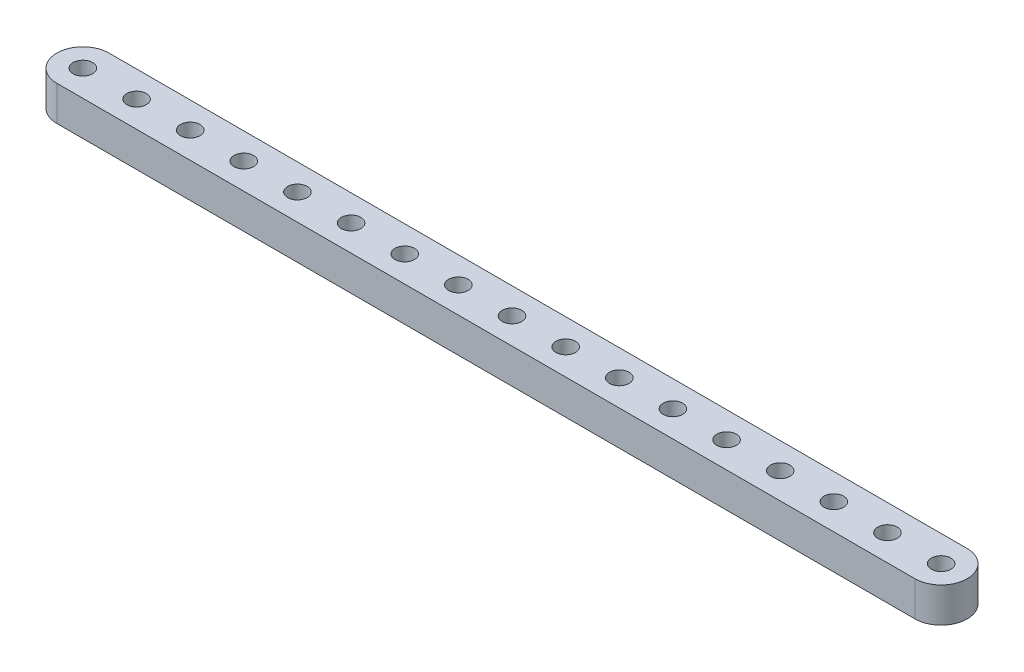
ISO-10303-21;
HEADER;
FILE_DESCRIPTION(('STEP AP214'),'2;1');
FILE_NAME('part.step','',(''),(''),'','','');
FILE_SCHEMA(('AUTOMOTIVE_DESIGN { 1 0 10303 214 1 1 1 1 }'));
ENDSEC;
DATA;
#1=APPLICATION_CONTEXT('core data for automotive mechanical design processes');
#2=APPLICATION_PROTOCOL_DEFINITION('international standard','automotive_design',2000,#1);
#3=PRODUCT_CONTEXT('',#1,'mechanical');
#4=PRODUCT('Part','Part','',(#3));
#5=PRODUCT_RELATED_PRODUCT_CATEGORY('part','',(#4));
#6=PRODUCT_DEFINITION_FORMATION('','',#4);
#7=PRODUCT_DEFINITION_CONTEXT('part definition',#1,'design');
#8=PRODUCT_DEFINITION('design','',#6,#7);
#9=PRODUCT_DEFINITION_SHAPE('','',#8);
#10=(LENGTH_UNIT() NAMED_UNIT(*) SI_UNIT(.MILLI.,.METRE.));
#11=(NAMED_UNIT(*) PLANE_ANGLE_UNIT() SI_UNIT($,.RADIAN.));
#12=(NAMED_UNIT(*) SI_UNIT($,.STERADIAN.) SOLID_ANGLE_UNIT());
#13=UNCERTAINTY_MEASURE_WITH_UNIT(LENGTH_MEASURE(1.E-05),#10,'distance_accuracy_value','');
#14=(GEOMETRIC_REPRESENTATION_CONTEXT(3) GLOBAL_UNCERTAINTY_ASSIGNED_CONTEXT((#13)) GLOBAL_UNIT_ASSIGNED_CONTEXT((#10,
#11,#12)) REPRESENTATION_CONTEXT('',''));
#15=CARTESIAN_POINT('',(0.,0.,0.));
#16=DIRECTION('',(0.,0.,1.));
#17=DIRECTION('',(1.,0.,0.));
#18=AXIS2_PLACEMENT_3D('',#15,#16,#17);
#19=CARTESIAN_POINT('',(78.232,0.,0.));
#20=DIRECTION('',(0.,1.,0.));
#21=DIRECTION('',(0.,0.,1.));
#22=AXIS2_PLACEMENT_3D('',#19,#20,#21);
#23=CYLINDRICAL_SURFACE('',#22,4.76250000000002);
#24=CARTESIAN_POINT('',(78.232,6.35,0.));
#25=DIRECTION('',(0.,1.,0.));
#26=DIRECTION('',(0.,0.,1.));
#27=AXIS2_PLACEMENT_3D('',#24,#25,#26);
#28=CIRCLE('',#27,4.76250000000002);
#29=CARTESIAN_POINT('',(78.232,6.35,4.76250000000002));
#30=VERTEX_POINT('',#29);
#31=CARTESIAN_POINT('',(78.232,6.35,-4.76250000000002));
#32=VERTEX_POINT('',#31);
#33=EDGE_CURVE('E99',#30,#32,#28,.T.);
#34=ORIENTED_EDGE('',*,*,#33,.F.);
#35=DIRECTION('',(0.,1.,0.));
#36=VECTOR('',#35,1.);
#37=CARTESIAN_POINT('',(78.232,0.,4.76250000000002));
#38=LINE('',#37,#36);
#39=CARTESIAN_POINT('',(78.232,0.,4.76250000000002));
#40=VERTEX_POINT('',#39);
#41=EDGE_CURVE('E11',#40,#30,#38,.T.);
#42=ORIENTED_EDGE('',*,*,#41,.F.);
#43=CARTESIAN_POINT('',(78.232,0.,0.));
#44=DIRECTION('',(0.,1.,0.));
#45=DIRECTION('',(0.,0.,1.));
#46=AXIS2_PLACEMENT_3D('',#43,#44,#45);
#47=CIRCLE('',#46,4.76250000000002);
#48=CARTESIAN_POINT('',(78.232,0.,-4.76250000000002));
#49=VERTEX_POINT('',#48);
#50=EDGE_CURVE('E92',#40,#49,#47,.T.);
#51=ORIENTED_EDGE('',*,*,#50,.T.);
#52=DIRECTION('',(0.,1.,0.));
#53=VECTOR('',#52,1.);
#54=CARTESIAN_POINT('',(78.232,0.,-4.76250000000002));
#55=LINE('',#54,#53);
#56=EDGE_CURVE('E37',#49,#32,#55,.T.);
#57=ORIENTED_EDGE('',*,*,#56,.T.);
#58=EDGE_LOOP('',(#34,#42,#51,#57));
#59=FACE_BOUND('',#58,.T.);
#60=ADVANCED_FACE('F34',(#59),#23,.T.);
#61=CARTESIAN_POINT('',(-78.232,0.,4.76250000000002));
#62=DIRECTION('',(0.,0.,1.));
#63=DIRECTION('',(1.,0.,0.));
#64=AXIS2_PLACEMENT_3D('',#61,#62,#63);
#65=PLANE('',#64);
#66=DIRECTION('',(1.,0.,0.));
#67=VECTOR('',#66,1.);
#68=CARTESIAN_POINT('',(-78.232,6.35,4.76250000000002));
#69=LINE('',#68,#67);
#70=CARTESIAN_POINT('',(-78.232,6.35,4.76250000000002));
#71=VERTEX_POINT('',#70);
#72=EDGE_CURVE('E94',#71,#30,#69,.T.);
#73=ORIENTED_EDGE('',*,*,#72,.F.);
#74=DIRECTION('',(0.,1.,0.));
#75=VECTOR('',#74,1.);
#76=CARTESIAN_POINT('',(-78.232,0.,4.76250000000002));
#77=LINE('',#76,#75);
#78=CARTESIAN_POINT('',(-78.232,0.,4.76250000000002));
#79=VERTEX_POINT('',#78);
#80=EDGE_CURVE('E43',#79,#71,#77,.T.);
#81=ORIENTED_EDGE('',*,*,#80,.F.);
#82=DIRECTION('',(1.,0.,0.));
#83=VECTOR('',#82,1.);
#84=CARTESIAN_POINT('',(-78.232,0.,4.76250000000002));
#85=LINE('',#84,#83);
#86=EDGE_CURVE('E89',#79,#40,#85,.T.);
#87=ORIENTED_EDGE('',*,*,#86,.T.);
#88=ORIENTED_EDGE('',*,*,#41,.T.);
#89=EDGE_LOOP('',(#73,#81,#87,#88));
#90=FACE_BOUND('',#89,.T.);
#91=ADVANCED_FACE('F110',(#90),#65,.T.);
#92=CARTESIAN_POINT('',(-78.232,0.,0.));
#93=DIRECTION('',(0.,1.,0.));
#94=DIRECTION('',(0.,0.,1.));
#95=AXIS2_PLACEMENT_3D('',#92,#93,#94);
#96=CYLINDRICAL_SURFACE('',#95,4.76250000000001);
#97=CARTESIAN_POINT('',(-78.232,6.35,0.));
#98=DIRECTION('',(0.,1.,0.));
#99=DIRECTION('',(0.,0.,1.));
#100=AXIS2_PLACEMENT_3D('',#97,#98,#99);
#101=CIRCLE('',#100,4.76250000000001);
#102=CARTESIAN_POINT('',(-78.232,6.35,-4.7625));
#103=VERTEX_POINT('',#102);
#104=EDGE_CURVE('E84',#103,#71,#101,.T.);
#105=ORIENTED_EDGE('',*,*,#104,.F.);
#106=DIRECTION('',(0.,1.,0.));
#107=VECTOR('',#106,1.);
#108=CARTESIAN_POINT('',(-78.232,0.,-4.7625));
#109=LINE('',#108,#107);
#110=CARTESIAN_POINT('',(-78.232,0.,-4.7625));
#111=VERTEX_POINT('',#110);
#112=EDGE_CURVE('E79',#111,#103,#109,.T.);
#113=ORIENTED_EDGE('',*,*,#112,.F.);
#114=CARTESIAN_POINT('',(-78.232,0.,0.));
#115=DIRECTION('',(0.,1.,0.));
#116=DIRECTION('',(0.,0.,1.));
#117=AXIS2_PLACEMENT_3D('',#114,#115,#116);
#118=CIRCLE('',#117,4.76250000000001);
#119=EDGE_CURVE('E82',#111,#79,#118,.T.);
#120=ORIENTED_EDGE('',*,*,#119,.T.);
#121=ORIENTED_EDGE('',*,*,#80,.T.);
#122=EDGE_LOOP('',(#105,#113,#120,#121));
#123=FACE_BOUND('',#122,.T.);
#124=ADVANCED_FACE('F81',(#123),#96,.T.);
#125=CARTESIAN_POINT('',(78.232,0.,-4.76250000000002));
#126=DIRECTION('',(0.,0.,-1.));
#127=DIRECTION('',(-1.,0.,0.));
#128=AXIS2_PLACEMENT_3D('',#125,#126,#127);
#129=PLANE('',#128);
#130=DIRECTION('',(-1.,0.,0.));
#131=VECTOR('',#130,1.);
#132=CARTESIAN_POINT('',(78.232,6.35,-4.76250000000002));
#133=LINE('',#132,#131);
#134=EDGE_CURVE('E102',#32,#103,#133,.T.);
#135=ORIENTED_EDGE('',*,*,#134,.F.);
#136=ORIENTED_EDGE('',*,*,#56,.F.);
#137=DIRECTION('',(-1.,0.,0.));
#138=VECTOR('',#137,1.);
#139=CARTESIAN_POINT('',(78.232,0.,-4.76250000000002));
#140=LINE('',#139,#138);
#141=EDGE_CURVE('E88',#49,#111,#140,.T.);
#142=ORIENTED_EDGE('',*,*,#141,.T.);
#143=ORIENTED_EDGE('',*,*,#112,.T.);
#144=EDGE_LOOP('',(#135,#136,#142,#143));
#145=FACE_BOUND('',#144,.T.);
#146=ADVANCED_FACE('F91',(#145),#129,.T.);
#147=CARTESIAN_POINT('',(78.232,0.,0.));
#148=DIRECTION('',(0.,1.,0.));
#149=DIRECTION('',(0.,0.,1.));
#150=AXIS2_PLACEMENT_3D('',#147,#148,#149);
#151=PLANE('',#150);
#152=CARTESIAN_POINT('',(-78.232,0.,0.));
#153=DIRECTION('',(0.,1.,0.));
#154=DIRECTION('',(0.,0.,-1.));
#155=AXIS2_PLACEMENT_3D('',#152,#153,#154);
#156=CIRCLE('',#155,1.77799999999997);
#157=CARTESIAN_POINT('',(-78.232,0.,-1.77799999999996));
#158=VERTEX_POINT('',#157);
#159=EDGE_CURVE('E203',#158,#158,#156,.T.);
#160=ORIENTED_EDGE('',*,*,#159,.T.);
#161=EDGE_LOOP('',(#160));
#162=FACE_BOUND('',#161,.T.);
#163=CARTESIAN_POINT('',(-68.453,0.,0.));
#164=DIRECTION('',(0.,1.,0.));
#165=DIRECTION('',(0.,0.,-1.));
#166=AXIS2_PLACEMENT_3D('',#163,#164,#165);
#167=CIRCLE('',#166,1.77799999999999);
#168=CARTESIAN_POINT('',(-68.453,0.,-1.77799999999999));
#169=VERTEX_POINT('',#168);
#170=EDGE_CURVE('E211',#169,#169,#167,.T.);
#171=ORIENTED_EDGE('',*,*,#170,.T.);
#172=EDGE_LOOP('',(#171));
#173=FACE_BOUND('',#172,.T.);
#174=CARTESIAN_POINT('',(-58.674,0.,0.));
#175=DIRECTION('',(0.,1.,0.));
#176=DIRECTION('',(0.,0.,-1.));
#177=AXIS2_PLACEMENT_3D('',#174,#175,#176);
#178=CIRCLE('',#177,1.77799999999999);
#179=CARTESIAN_POINT('',(-58.674,0.,-1.77799999999999));
#180=VERTEX_POINT('',#179);
#181=EDGE_CURVE('E217',#180,#180,#178,.T.);
#182=ORIENTED_EDGE('',*,*,#181,.T.);
#183=EDGE_LOOP('',(#182));
#184=FACE_BOUND('',#183,.T.);
#185=CARTESIAN_POINT('',(-48.895,0.,0.));
#186=DIRECTION('',(0.,1.,0.));
#187=DIRECTION('',(0.,0.,-1.));
#188=AXIS2_PLACEMENT_3D('',#185,#186,#187);
#189=CIRCLE('',#188,1.77799999999999);
#190=CARTESIAN_POINT('',(-48.895,0.,-1.77799999999999));
#191=VERTEX_POINT('',#190);
#192=EDGE_CURVE('E223',#191,#191,#189,.T.);
#193=ORIENTED_EDGE('',*,*,#192,.T.);
#194=EDGE_LOOP('',(#193));
#195=FACE_BOUND('',#194,.T.);
#196=CARTESIAN_POINT('',(-39.116,0.,0.));
#197=DIRECTION('',(0.,1.,0.));
#198=DIRECTION('',(0.,0.,-1.));
#199=AXIS2_PLACEMENT_3D('',#196,#197,#198);
#200=CIRCLE('',#199,1.77799999999999);
#201=CARTESIAN_POINT('',(-39.116,0.,-1.77799999999999));
#202=VERTEX_POINT('',#201);
#203=EDGE_CURVE('E229',#202,#202,#200,.T.);
#204=ORIENTED_EDGE('',*,*,#203,.T.);
#205=EDGE_LOOP('',(#204));
#206=FACE_BOUND('',#205,.T.);
#207=CARTESIAN_POINT('',(-29.337,0.,0.));
#208=DIRECTION('',(0.,1.,0.));
#209=DIRECTION('',(0.,0.,-1.));
#210=AXIS2_PLACEMENT_3D('',#207,#208,#209);
#211=CIRCLE('',#210,1.77799999999999);
#212=CARTESIAN_POINT('',(-29.337,0.,-1.77799999999998));
#213=VERTEX_POINT('',#212);
#214=EDGE_CURVE('E235',#213,#213,#211,.T.);
#215=ORIENTED_EDGE('',*,*,#214,.T.);
#216=EDGE_LOOP('',(#215));
#217=FACE_BOUND('',#216,.T.);
#218=CARTESIAN_POINT('',(-19.558,0.,0.));
#219=DIRECTION('',(0.,1.,0.));
#220=DIRECTION('',(0.,0.,-1.));
#221=AXIS2_PLACEMENT_3D('',#218,#219,#220);
#222=CIRCLE('',#221,1.77799999999999);
#223=CARTESIAN_POINT('',(-19.558,0.,-1.77799999999998));
#224=VERTEX_POINT('',#223);
#225=EDGE_CURVE('E241',#224,#224,#222,.T.);
#226=ORIENTED_EDGE('',*,*,#225,.T.);
#227=EDGE_LOOP('',(#226));
#228=FACE_BOUND('',#227,.T.);
#229=CARTESIAN_POINT('',(-9.77900000000001,0.,0.));
#230=DIRECTION('',(0.,1.,0.));
#231=DIRECTION('',(0.,0.,-1.));
#232=AXIS2_PLACEMENT_3D('',#229,#230,#231);
#233=CIRCLE('',#232,1.77799999999999);
#234=CARTESIAN_POINT('',(-9.77900000000001,0.,-1.77799999999998));
#235=VERTEX_POINT('',#234);
#236=EDGE_CURVE('E247',#235,#235,#233,.T.);
#237=ORIENTED_EDGE('',*,*,#236,.T.);
#238=EDGE_LOOP('',(#237));
#239=FACE_BOUND('',#238,.T.);
#240=CARTESIAN_POINT('',(0.,0.,0.));
#241=DIRECTION('',(0.,1.,0.));
#242=DIRECTION('',(0.,0.,-1.));
#243=AXIS2_PLACEMENT_3D('',#240,#241,#242);
#244=CIRCLE('',#243,1.77799999999999);
#245=CARTESIAN_POINT('',(0.,0.,-1.77799999999998));
#246=VERTEX_POINT('',#245);
#247=EDGE_CURVE('E253',#246,#246,#244,.T.);
#248=ORIENTED_EDGE('',*,*,#247,.T.);
#249=EDGE_LOOP('',(#248));
#250=FACE_BOUND('',#249,.T.);
#251=CARTESIAN_POINT('',(9.77899999999998,0.,0.));
#252=DIRECTION('',(0.,1.,0.));
#253=DIRECTION('',(0.,0.,-1.));
#254=AXIS2_PLACEMENT_3D('',#251,#252,#253);
#255=CIRCLE('',#254,1.77799999999999);
#256=CARTESIAN_POINT('',(9.77899999999998,0.,-1.77799999999998));
#257=VERTEX_POINT('',#256);
#258=EDGE_CURVE('E259',#257,#257,#255,.T.);
#259=ORIENTED_EDGE('',*,*,#258,.T.);
#260=EDGE_LOOP('',(#259));
#261=FACE_BOUND('',#260,.T.);
#262=CARTESIAN_POINT('',(19.558,0.,0.));
#263=DIRECTION('',(0.,1.,0.));
#264=DIRECTION('',(0.,0.,-1.));
#265=AXIS2_PLACEMENT_3D('',#262,#263,#264);
#266=CIRCLE('',#265,1.77799999999999);
#267=CARTESIAN_POINT('',(19.558,0.,-1.77799999999998));
#268=VERTEX_POINT('',#267);
#269=EDGE_CURVE('E265',#268,#268,#266,.T.);
#270=ORIENTED_EDGE('',*,*,#269,.T.);
#271=EDGE_LOOP('',(#270));
#272=FACE_BOUND('',#271,.T.);
#273=CARTESIAN_POINT('',(29.337,0.,0.));
#274=DIRECTION('',(0.,1.,0.));
#275=DIRECTION('',(0.,0.,-1.));
#276=AXIS2_PLACEMENT_3D('',#273,#274,#275);
#277=CIRCLE('',#276,1.77799999999999);
#278=CARTESIAN_POINT('',(29.337,0.,-1.77799999999998));
#279=VERTEX_POINT('',#278);
#280=EDGE_CURVE('E271',#279,#279,#277,.T.);
#281=ORIENTED_EDGE('',*,*,#280,.T.);
#282=EDGE_LOOP('',(#281));
#283=FACE_BOUND('',#282,.T.);
#284=CARTESIAN_POINT('',(39.116,0.,0.));
#285=DIRECTION('',(0.,1.,0.));
#286=DIRECTION('',(0.,0.,-1.));
#287=AXIS2_PLACEMENT_3D('',#284,#285,#286);
#288=CIRCLE('',#287,1.77799999999999);
#289=CARTESIAN_POINT('',(39.116,0.,-1.77799999999998));
#290=VERTEX_POINT('',#289);
#291=EDGE_CURVE('E277',#290,#290,#288,.T.);
#292=ORIENTED_EDGE('',*,*,#291,.T.);
#293=EDGE_LOOP('',(#292));
#294=FACE_BOUND('',#293,.T.);
#295=CARTESIAN_POINT('',(48.895,0.,0.));
#296=DIRECTION('',(0.,1.,0.));
#297=DIRECTION('',(0.,0.,-1.));
#298=AXIS2_PLACEMENT_3D('',#295,#296,#297);
#299=CIRCLE('',#298,1.77799999999999);
#300=CARTESIAN_POINT('',(48.895,0.,-1.77799999999998));
#301=VERTEX_POINT('',#300);
#302=EDGE_CURVE('E283',#301,#301,#299,.T.);
#303=ORIENTED_EDGE('',*,*,#302,.T.);
#304=EDGE_LOOP('',(#303));
#305=FACE_BOUND('',#304,.T.);
#306=CARTESIAN_POINT('',(58.674,0.,0.));
#307=DIRECTION('',(0.,1.,0.));
#308=DIRECTION('',(0.,0.,-1.));
#309=AXIS2_PLACEMENT_3D('',#306,#307,#308);
#310=CIRCLE('',#309,1.77799999999999);
#311=CARTESIAN_POINT('',(58.674,0.,-1.77799999999998));
#312=VERTEX_POINT('',#311);
#313=EDGE_CURVE('E289',#312,#312,#310,.T.);
#314=ORIENTED_EDGE('',*,*,#313,.T.);
#315=EDGE_LOOP('',(#314));
#316=FACE_BOUND('',#315,.T.);
#317=CARTESIAN_POINT('',(68.453,0.,0.));
#318=DIRECTION('',(0.,1.,0.));
#319=DIRECTION('',(0.,0.,-1.));
#320=AXIS2_PLACEMENT_3D('',#317,#318,#319);
#321=CIRCLE('',#320,1.77799999999999);
#322=CARTESIAN_POINT('',(68.453,0.,-1.77799999999997));
#323=VERTEX_POINT('',#322);
#324=EDGE_CURVE('E295',#323,#323,#321,.T.);
#325=ORIENTED_EDGE('',*,*,#324,.T.);
#326=EDGE_LOOP('',(#325));
#327=FACE_BOUND('',#326,.T.);
#328=CARTESIAN_POINT('',(78.232,0.,0.));
#329=DIRECTION('',(0.,1.,0.));
#330=DIRECTION('',(0.,0.,-1.));
#331=AXIS2_PLACEMENT_3D('',#328,#329,#330);
#332=CIRCLE('',#331,1.77799999999999);
#333=CARTESIAN_POINT('',(78.232,0.,-1.77799999999997));
#334=VERTEX_POINT('',#333);
#335=EDGE_CURVE('E103',#334,#334,#332,.T.);
#336=ORIENTED_EDGE('',*,*,#335,.T.);
#337=EDGE_LOOP('',(#336));
#338=FACE_BOUND('',#337,.T.);
#339=ORIENTED_EDGE('',*,*,#50,.F.);
#340=ORIENTED_EDGE('',*,*,#86,.F.);
#341=ORIENTED_EDGE('',*,*,#119,.F.);
#342=ORIENTED_EDGE('',*,*,#141,.F.);
#343=EDGE_LOOP('',(#339,#340,#341,#342));
#344=FACE_BOUND('',#343,.T.);
#345=ADVANCED_FACE('F87',(#162,#173,#184,#195,#206,#217,#228,#239,#250,#261,#272,#283,#294,#305,
#316,#327,#338,#344),#151,.F.);
#346=CARTESIAN_POINT('',(78.232,6.35,0.));
#347=DIRECTION('',(0.,1.,0.));
#348=DIRECTION('',(0.,0.,1.));
#349=AXIS2_PLACEMENT_3D('',#346,#347,#348);
#350=PLANE('',#349);
#351=CARTESIAN_POINT('',(-78.232,6.35,0.));
#352=DIRECTION('',(0.,1.,0.));
#353=DIRECTION('',(0.,0.,-1.));
#354=AXIS2_PLACEMENT_3D('',#351,#352,#353);
#355=CIRCLE('',#354,1.77799999999997);
#356=CARTESIAN_POINT('',(-78.232,6.35,-1.77799999999996));
#357=VERTEX_POINT('',#356);
#358=EDGE_CURVE('E206',#357,#357,#355,.T.);
#359=ORIENTED_EDGE('',*,*,#358,.F.);
#360=EDGE_LOOP('',(#359));
#361=FACE_BOUND('',#360,.T.);
#362=CARTESIAN_POINT('',(-68.453,6.35,0.));
#363=DIRECTION('',(0.,1.,0.));
#364=DIRECTION('',(0.,0.,-1.));
#365=AXIS2_PLACEMENT_3D('',#362,#363,#364);
#366=CIRCLE('',#365,1.77799999999999);
#367=CARTESIAN_POINT('',(-68.453,6.35,-1.77799999999999));
#368=VERTEX_POINT('',#367);
#369=EDGE_CURVE('E208',#368,#368,#366,.T.);
#370=ORIENTED_EDGE('',*,*,#369,.F.);
#371=EDGE_LOOP('',(#370));
#372=FACE_BOUND('',#371,.T.);
#373=CARTESIAN_POINT('',(-58.674,6.35,0.));
#374=DIRECTION('',(0.,1.,0.));
#375=DIRECTION('',(0.,0.,-1.));
#376=AXIS2_PLACEMENT_3D('',#373,#374,#375);
#377=CIRCLE('',#376,1.77799999999999);
#378=CARTESIAN_POINT('',(-58.674,6.35,-1.77799999999999));
#379=VERTEX_POINT('',#378);
#380=EDGE_CURVE('E214',#379,#379,#377,.T.);
#381=ORIENTED_EDGE('',*,*,#380,.F.);
#382=EDGE_LOOP('',(#381));
#383=FACE_BOUND('',#382,.T.);
#384=CARTESIAN_POINT('',(-48.895,6.35,0.));
#385=DIRECTION('',(0.,1.,0.));
#386=DIRECTION('',(0.,0.,-1.));
#387=AXIS2_PLACEMENT_3D('',#384,#385,#386);
#388=CIRCLE('',#387,1.77799999999999);
#389=CARTESIAN_POINT('',(-48.895,6.35,-1.77799999999999));
#390=VERTEX_POINT('',#389);
#391=EDGE_CURVE('E220',#390,#390,#388,.T.);
#392=ORIENTED_EDGE('',*,*,#391,.F.);
#393=EDGE_LOOP('',(#392));
#394=FACE_BOUND('',#393,.T.);
#395=CARTESIAN_POINT('',(-39.116,6.35,0.));
#396=DIRECTION('',(0.,1.,0.));
#397=DIRECTION('',(0.,0.,-1.));
#398=AXIS2_PLACEMENT_3D('',#395,#396,#397);
#399=CIRCLE('',#398,1.77799999999999);
#400=CARTESIAN_POINT('',(-39.116,6.35,-1.77799999999999));
#401=VERTEX_POINT('',#400);
#402=EDGE_CURVE('E226',#401,#401,#399,.T.);
#403=ORIENTED_EDGE('',*,*,#402,.F.);
#404=EDGE_LOOP('',(#403));
#405=FACE_BOUND('',#404,.T.);
#406=CARTESIAN_POINT('',(-29.337,6.35,0.));
#407=DIRECTION('',(0.,1.,0.));
#408=DIRECTION('',(0.,0.,-1.));
#409=AXIS2_PLACEMENT_3D('',#406,#407,#408);
#410=CIRCLE('',#409,1.77799999999999);
#411=CARTESIAN_POINT('',(-29.337,6.35,-1.77799999999998));
#412=VERTEX_POINT('',#411);
#413=EDGE_CURVE('E232',#412,#412,#410,.T.);
#414=ORIENTED_EDGE('',*,*,#413,.F.);
#415=EDGE_LOOP('',(#414));
#416=FACE_BOUND('',#415,.T.);
#417=CARTESIAN_POINT('',(-19.558,6.35,0.));
#418=DIRECTION('',(0.,1.,0.));
#419=DIRECTION('',(0.,0.,-1.));
#420=AXIS2_PLACEMENT_3D('',#417,#418,#419);
#421=CIRCLE('',#420,1.77799999999999);
#422=CARTESIAN_POINT('',(-19.558,6.35,-1.77799999999998));
#423=VERTEX_POINT('',#422);
#424=EDGE_CURVE('E238',#423,#423,#421,.T.);
#425=ORIENTED_EDGE('',*,*,#424,.F.);
#426=EDGE_LOOP('',(#425));
#427=FACE_BOUND('',#426,.T.);
#428=CARTESIAN_POINT('',(-9.77900000000001,6.35,0.));
#429=DIRECTION('',(0.,1.,0.));
#430=DIRECTION('',(0.,0.,-1.));
#431=AXIS2_PLACEMENT_3D('',#428,#429,#430);
#432=CIRCLE('',#431,1.77799999999999);
#433=CARTESIAN_POINT('',(-9.77900000000001,6.35,-1.77799999999998));
#434=VERTEX_POINT('',#433);
#435=EDGE_CURVE('E244',#434,#434,#432,.T.);
#436=ORIENTED_EDGE('',*,*,#435,.F.);
#437=EDGE_LOOP('',(#436));
#438=FACE_BOUND('',#437,.T.);
#439=CARTESIAN_POINT('',(0.,6.35,0.));
#440=DIRECTION('',(0.,1.,0.));
#441=DIRECTION('',(0.,0.,-1.));
#442=AXIS2_PLACEMENT_3D('',#439,#440,#441);
#443=CIRCLE('',#442,1.77799999999999);
#444=CARTESIAN_POINT('',(0.,6.35,-1.77799999999998));
#445=VERTEX_POINT('',#444);
#446=EDGE_CURVE('E250',#445,#445,#443,.T.);
#447=ORIENTED_EDGE('',*,*,#446,.F.);
#448=EDGE_LOOP('',(#447));
#449=FACE_BOUND('',#448,.T.);
#450=CARTESIAN_POINT('',(9.77899999999998,6.35,0.));
#451=DIRECTION('',(0.,1.,0.));
#452=DIRECTION('',(0.,0.,-1.));
#453=AXIS2_PLACEMENT_3D('',#450,#451,#452);
#454=CIRCLE('',#453,1.77799999999999);
#455=CARTESIAN_POINT('',(9.77899999999998,6.35,-1.77799999999998));
#456=VERTEX_POINT('',#455);
#457=EDGE_CURVE('E256',#456,#456,#454,.T.);
#458=ORIENTED_EDGE('',*,*,#457,.F.);
#459=EDGE_LOOP('',(#458));
#460=FACE_BOUND('',#459,.T.);
#461=CARTESIAN_POINT('',(19.558,6.35,0.));
#462=DIRECTION('',(0.,1.,0.));
#463=DIRECTION('',(0.,0.,-1.));
#464=AXIS2_PLACEMENT_3D('',#461,#462,#463);
#465=CIRCLE('',#464,1.77799999999999);
#466=CARTESIAN_POINT('',(19.558,6.35,-1.77799999999998));
#467=VERTEX_POINT('',#466);
#468=EDGE_CURVE('E262',#467,#467,#465,.T.);
#469=ORIENTED_EDGE('',*,*,#468,.F.);
#470=EDGE_LOOP('',(#469));
#471=FACE_BOUND('',#470,.T.);
#472=CARTESIAN_POINT('',(29.337,6.35,0.));
#473=DIRECTION('',(0.,1.,0.));
#474=DIRECTION('',(0.,0.,-1.));
#475=AXIS2_PLACEMENT_3D('',#472,#473,#474);
#476=CIRCLE('',#475,1.77799999999999);
#477=CARTESIAN_POINT('',(29.337,6.35,-1.77799999999998));
#478=VERTEX_POINT('',#477);
#479=EDGE_CURVE('E268',#478,#478,#476,.T.);
#480=ORIENTED_EDGE('',*,*,#479,.F.);
#481=EDGE_LOOP('',(#480));
#482=FACE_BOUND('',#481,.T.);
#483=CARTESIAN_POINT('',(39.116,6.35,0.));
#484=DIRECTION('',(0.,1.,0.));
#485=DIRECTION('',(0.,0.,-1.));
#486=AXIS2_PLACEMENT_3D('',#483,#484,#485);
#487=CIRCLE('',#486,1.77799999999999);
#488=CARTESIAN_POINT('',(39.116,6.35,-1.77799999999998));
#489=VERTEX_POINT('',#488);
#490=EDGE_CURVE('E274',#489,#489,#487,.T.);
#491=ORIENTED_EDGE('',*,*,#490,.F.);
#492=EDGE_LOOP('',(#491));
#493=FACE_BOUND('',#492,.T.);
#494=CARTESIAN_POINT('',(48.895,6.35,0.));
#495=DIRECTION('',(0.,1.,0.));
#496=DIRECTION('',(0.,0.,-1.));
#497=AXIS2_PLACEMENT_3D('',#494,#495,#496);
#498=CIRCLE('',#497,1.77799999999999);
#499=CARTESIAN_POINT('',(48.895,6.35,-1.77799999999998));
#500=VERTEX_POINT('',#499);
#501=EDGE_CURVE('E280',#500,#500,#498,.T.);
#502=ORIENTED_EDGE('',*,*,#501,.F.);
#503=EDGE_LOOP('',(#502));
#504=FACE_BOUND('',#503,.T.);
#505=CARTESIAN_POINT('',(58.674,6.35,0.));
#506=DIRECTION('',(0.,1.,0.));
#507=DIRECTION('',(0.,0.,-1.));
#508=AXIS2_PLACEMENT_3D('',#505,#506,#507);
#509=CIRCLE('',#508,1.77799999999999);
#510=CARTESIAN_POINT('',(58.674,6.35,-1.77799999999998));
#511=VERTEX_POINT('',#510);
#512=EDGE_CURVE('E286',#511,#511,#509,.T.);
#513=ORIENTED_EDGE('',*,*,#512,.F.);
#514=EDGE_LOOP('',(#513));
#515=FACE_BOUND('',#514,.T.);
#516=CARTESIAN_POINT('',(68.453,6.35,0.));
#517=DIRECTION('',(0.,1.,0.));
#518=DIRECTION('',(0.,0.,-1.));
#519=AXIS2_PLACEMENT_3D('',#516,#517,#518);
#520=CIRCLE('',#519,1.77799999999999);
#521=CARTESIAN_POINT('',(68.453,6.35,-1.77799999999997));
#522=VERTEX_POINT('',#521);
#523=EDGE_CURVE('E292',#522,#522,#520,.T.);
#524=ORIENTED_EDGE('',*,*,#523,.F.);
#525=EDGE_LOOP('',(#524));
#526=FACE_BOUND('',#525,.T.);
#527=CARTESIAN_POINT('',(78.232,6.35,0.));
#528=DIRECTION('',(0.,1.,0.));
#529=DIRECTION('',(0.,0.,-1.));
#530=AXIS2_PLACEMENT_3D('',#527,#528,#529);
#531=CIRCLE('',#530,1.77799999999999);
#532=CARTESIAN_POINT('',(78.232,6.35,-1.77799999999997));
#533=VERTEX_POINT('',#532);
#534=EDGE_CURVE('E298',#533,#533,#531,.T.);
#535=ORIENTED_EDGE('',*,*,#534,.F.);
#536=EDGE_LOOP('',(#535));
#537=FACE_BOUND('',#536,.T.);
#538=ORIENTED_EDGE('',*,*,#33,.T.);
#539=ORIENTED_EDGE('',*,*,#134,.T.);
#540=ORIENTED_EDGE('',*,*,#104,.T.);
#541=ORIENTED_EDGE('',*,*,#72,.T.);
#542=EDGE_LOOP('',(#538,#539,#540,#541));
#543=FACE_BOUND('',#542,.T.);
#544=ADVANCED_FACE('F109',(#361,#372,#383,#394,#405,#416,#427,#438,#449,#460,#471,#482,#493,
#504,#515,#526,#537,#543),#350,.T.);
#545=CARTESIAN_POINT('',(78.232,0.,0.));
#546=DIRECTION('',(0.,1.,0.));
#547=DIRECTION('',(0.,0.,1.));
#548=AXIS2_PLACEMENT_3D('',#545,#546,#547);
#549=CYLINDRICAL_SURFACE('',#548,1.77799999999999);
#550=ORIENTED_EDGE('',*,*,#335,.F.);
#551=EDGE_LOOP('',(#550));
#552=FACE_BOUND('',#551,.T.);
#553=ORIENTED_EDGE('',*,*,#534,.T.);
#554=EDGE_LOOP('',(#553));
#555=FACE_BOUND('',#554,.T.);
#556=ADVANCED_FACE('F128',(#552,#555),#549,.F.);
#557=CARTESIAN_POINT('',(68.453,0.,0.));
#558=DIRECTION('',(0.,1.,0.));
#559=DIRECTION('',(0.,0.,1.));
#560=AXIS2_PLACEMENT_3D('',#557,#558,#559);
#561=CYLINDRICAL_SURFACE('',#560,1.77799999999999);
#562=ORIENTED_EDGE('',*,*,#324,.F.);
#563=EDGE_LOOP('',(#562));
#564=FACE_BOUND('',#563,.T.);
#565=ORIENTED_EDGE('',*,*,#523,.T.);
#566=EDGE_LOOP('',(#565));
#567=FACE_BOUND('',#566,.T.);
#568=ADVANCED_FACE('F135',(#564,#567),#561,.F.);
#569=CARTESIAN_POINT('',(58.674,0.,0.));
#570=DIRECTION('',(0.,1.,0.));
#571=DIRECTION('',(0.,0.,1.));
#572=AXIS2_PLACEMENT_3D('',#569,#570,#571);
#573=CYLINDRICAL_SURFACE('',#572,1.77799999999999);
#574=ORIENTED_EDGE('',*,*,#313,.F.);
#575=EDGE_LOOP('',(#574));
#576=FACE_BOUND('',#575,.T.);
#577=ORIENTED_EDGE('',*,*,#512,.T.);
#578=EDGE_LOOP('',(#577));
#579=FACE_BOUND('',#578,.T.);
#580=ADVANCED_FACE('F139',(#576,#579),#573,.F.);
#581=CARTESIAN_POINT('',(48.895,0.,0.));
#582=DIRECTION('',(0.,1.,0.));
#583=DIRECTION('',(0.,0.,1.));
#584=AXIS2_PLACEMENT_3D('',#581,#582,#583);
#585=CYLINDRICAL_SURFACE('',#584,1.77799999999999);
#586=ORIENTED_EDGE('',*,*,#302,.F.);
#587=EDGE_LOOP('',(#586));
#588=FACE_BOUND('',#587,.T.);
#589=ORIENTED_EDGE('',*,*,#501,.T.);
#590=EDGE_LOOP('',(#589));
#591=FACE_BOUND('',#590,.T.);
#592=ADVANCED_FACE('F143',(#588,#591),#585,.F.);
#593=CARTESIAN_POINT('',(39.116,0.,0.));
#594=DIRECTION('',(0.,1.,0.));
#595=DIRECTION('',(0.,0.,1.));
#596=AXIS2_PLACEMENT_3D('',#593,#594,#595);
#597=CYLINDRICAL_SURFACE('',#596,1.77799999999999);
#598=ORIENTED_EDGE('',*,*,#291,.F.);
#599=EDGE_LOOP('',(#598));
#600=FACE_BOUND('',#599,.T.);
#601=ORIENTED_EDGE('',*,*,#490,.T.);
#602=EDGE_LOOP('',(#601));
#603=FACE_BOUND('',#602,.T.);
#604=ADVANCED_FACE('F147',(#600,#603),#597,.F.);
#605=CARTESIAN_POINT('',(29.337,0.,0.));
#606=DIRECTION('',(0.,1.,0.));
#607=DIRECTION('',(0.,0.,1.));
#608=AXIS2_PLACEMENT_3D('',#605,#606,#607);
#609=CYLINDRICAL_SURFACE('',#608,1.77799999999999);
#610=ORIENTED_EDGE('',*,*,#280,.F.);
#611=EDGE_LOOP('',(#610));
#612=FACE_BOUND('',#611,.T.);
#613=ORIENTED_EDGE('',*,*,#479,.T.);
#614=EDGE_LOOP('',(#613));
#615=FACE_BOUND('',#614,.T.);
#616=ADVANCED_FACE('F151',(#612,#615),#609,.F.);
#617=CARTESIAN_POINT('',(19.558,0.,0.));
#618=DIRECTION('',(0.,1.,0.));
#619=DIRECTION('',(0.,0.,1.));
#620=AXIS2_PLACEMENT_3D('',#617,#618,#619);
#621=CYLINDRICAL_SURFACE('',#620,1.77799999999999);
#622=ORIENTED_EDGE('',*,*,#269,.F.);
#623=EDGE_LOOP('',(#622));
#624=FACE_BOUND('',#623,.T.);
#625=ORIENTED_EDGE('',*,*,#468,.T.);
#626=EDGE_LOOP('',(#625));
#627=FACE_BOUND('',#626,.T.);
#628=ADVANCED_FACE('F155',(#624,#627),#621,.F.);
#629=CARTESIAN_POINT('',(9.77899999999998,0.,0.));
#630=DIRECTION('',(0.,1.,0.));
#631=DIRECTION('',(0.,0.,1.));
#632=AXIS2_PLACEMENT_3D('',#629,#630,#631);
#633=CYLINDRICAL_SURFACE('',#632,1.77799999999999);
#634=ORIENTED_EDGE('',*,*,#258,.F.);
#635=EDGE_LOOP('',(#634));
#636=FACE_BOUND('',#635,.T.);
#637=ORIENTED_EDGE('',*,*,#457,.T.);
#638=EDGE_LOOP('',(#637));
#639=FACE_BOUND('',#638,.T.);
#640=ADVANCED_FACE('F159',(#636,#639),#633,.F.);
#641=CARTESIAN_POINT('',(0.,0.,0.));
#642=DIRECTION('',(0.,1.,0.));
#643=DIRECTION('',(0.,0.,1.));
#644=AXIS2_PLACEMENT_3D('',#641,#642,#643);
#645=CYLINDRICAL_SURFACE('',#644,1.77799999999999);
#646=ORIENTED_EDGE('',*,*,#247,.F.);
#647=EDGE_LOOP('',(#646));
#648=FACE_BOUND('',#647,.T.);
#649=ORIENTED_EDGE('',*,*,#446,.T.);
#650=EDGE_LOOP('',(#649));
#651=FACE_BOUND('',#650,.T.);
#652=ADVANCED_FACE('F163',(#648,#651),#645,.F.);
#653=CARTESIAN_POINT('',(-9.77900000000001,0.,0.));
#654=DIRECTION('',(0.,1.,0.));
#655=DIRECTION('',(0.,0.,1.));
#656=AXIS2_PLACEMENT_3D('',#653,#654,#655);
#657=CYLINDRICAL_SURFACE('',#656,1.77799999999999);
#658=ORIENTED_EDGE('',*,*,#236,.F.);
#659=EDGE_LOOP('',(#658));
#660=FACE_BOUND('',#659,.T.);
#661=ORIENTED_EDGE('',*,*,#435,.T.);
#662=EDGE_LOOP('',(#661));
#663=FACE_BOUND('',#662,.T.);
#664=ADVANCED_FACE('F167',(#660,#663),#657,.F.);
#665=CARTESIAN_POINT('',(-19.558,0.,0.));
#666=DIRECTION('',(0.,1.,0.));
#667=DIRECTION('',(0.,0.,1.));
#668=AXIS2_PLACEMENT_3D('',#665,#666,#667);
#669=CYLINDRICAL_SURFACE('',#668,1.77799999999999);
#670=ORIENTED_EDGE('',*,*,#225,.F.);
#671=EDGE_LOOP('',(#670));
#672=FACE_BOUND('',#671,.T.);
#673=ORIENTED_EDGE('',*,*,#424,.T.);
#674=EDGE_LOOP('',(#673));
#675=FACE_BOUND('',#674,.T.);
#676=ADVANCED_FACE('F171',(#672,#675),#669,.F.);
#677=CARTESIAN_POINT('',(-29.337,0.,0.));
#678=DIRECTION('',(0.,1.,0.));
#679=DIRECTION('',(0.,0.,1.));
#680=AXIS2_PLACEMENT_3D('',#677,#678,#679);
#681=CYLINDRICAL_SURFACE('',#680,1.77799999999999);
#682=ORIENTED_EDGE('',*,*,#214,.F.);
#683=EDGE_LOOP('',(#682));
#684=FACE_BOUND('',#683,.T.);
#685=ORIENTED_EDGE('',*,*,#413,.T.);
#686=EDGE_LOOP('',(#685));
#687=FACE_BOUND('',#686,.T.);
#688=ADVANCED_FACE('F175',(#684,#687),#681,.F.);
#689=CARTESIAN_POINT('',(-39.116,0.,0.));
#690=DIRECTION('',(0.,1.,0.));
#691=DIRECTION('',(0.,0.,1.));
#692=AXIS2_PLACEMENT_3D('',#689,#690,#691);
#693=CYLINDRICAL_SURFACE('',#692,1.77799999999999);
#694=ORIENTED_EDGE('',*,*,#203,.F.);
#695=EDGE_LOOP('',(#694));
#696=FACE_BOUND('',#695,.T.);
#697=ORIENTED_EDGE('',*,*,#402,.T.);
#698=EDGE_LOOP('',(#697));
#699=FACE_BOUND('',#698,.T.);
#700=ADVANCED_FACE('F179',(#696,#699),#693,.F.);
#701=CARTESIAN_POINT('',(-48.895,0.,0.));
#702=DIRECTION('',(0.,1.,0.));
#703=DIRECTION('',(0.,0.,1.));
#704=AXIS2_PLACEMENT_3D('',#701,#702,#703);
#705=CYLINDRICAL_SURFACE('',#704,1.77799999999999);
#706=ORIENTED_EDGE('',*,*,#192,.F.);
#707=EDGE_LOOP('',(#706));
#708=FACE_BOUND('',#707,.T.);
#709=ORIENTED_EDGE('',*,*,#391,.T.);
#710=EDGE_LOOP('',(#709));
#711=FACE_BOUND('',#710,.T.);
#712=ADVANCED_FACE('F183',(#708,#711),#705,.F.);
#713=CARTESIAN_POINT('',(-58.674,0.,0.));
#714=DIRECTION('',(0.,1.,0.));
#715=DIRECTION('',(0.,0.,1.));
#716=AXIS2_PLACEMENT_3D('',#713,#714,#715);
#717=CYLINDRICAL_SURFACE('',#716,1.77799999999999);
#718=ORIENTED_EDGE('',*,*,#181,.F.);
#719=EDGE_LOOP('',(#718));
#720=FACE_BOUND('',#719,.T.);
#721=ORIENTED_EDGE('',*,*,#380,.T.);
#722=EDGE_LOOP('',(#721));
#723=FACE_BOUND('',#722,.T.);
#724=ADVANCED_FACE('F187',(#720,#723),#717,.F.);
#725=CARTESIAN_POINT('',(-68.453,0.,0.));
#726=DIRECTION('',(0.,1.,0.));
#727=DIRECTION('',(0.,0.,1.));
#728=AXIS2_PLACEMENT_3D('',#725,#726,#727);
#729=CYLINDRICAL_SURFACE('',#728,1.77799999999999);
#730=ORIENTED_EDGE('',*,*,#170,.F.);
#731=EDGE_LOOP('',(#730));
#732=FACE_BOUND('',#731,.T.);
#733=ORIENTED_EDGE('',*,*,#369,.T.);
#734=EDGE_LOOP('',(#733));
#735=FACE_BOUND('',#734,.T.);
#736=ADVANCED_FACE('F191',(#732,#735),#729,.F.);
#737=CARTESIAN_POINT('',(-78.232,0.,0.));
#738=DIRECTION('',(0.,1.,0.));
#739=DIRECTION('',(0.,0.,1.));
#740=AXIS2_PLACEMENT_3D('',#737,#738,#739);
#741=CYLINDRICAL_SURFACE('',#740,1.77799999999997);
#742=ORIENTED_EDGE('',*,*,#159,.F.);
#743=EDGE_LOOP('',(#742));
#744=FACE_BOUND('',#743,.T.);
#745=ORIENTED_EDGE('',*,*,#358,.T.);
#746=EDGE_LOOP('',(#745));
#747=FACE_BOUND('',#746,.T.);
#748=ADVANCED_FACE('F195',(#744,#747),#741,.F.);
#749=CLOSED_SHELL('',(#60,#91,#124,#146,#345,#544,#556,#568,#580,#592,#604,#616,#628,#640,#652,
#664,#676,#688,#700,#712,#724,#736,#748));
#750=MANIFOLD_SOLID_BREP('B2',#749);
#751=ADVANCED_BREP_SHAPE_REPRESENTATION('',(#18,#750),#14);
#752=SHAPE_DEFINITION_REPRESENTATION(#9,#751);
ENDSEC;
END-ISO-10303-21;
